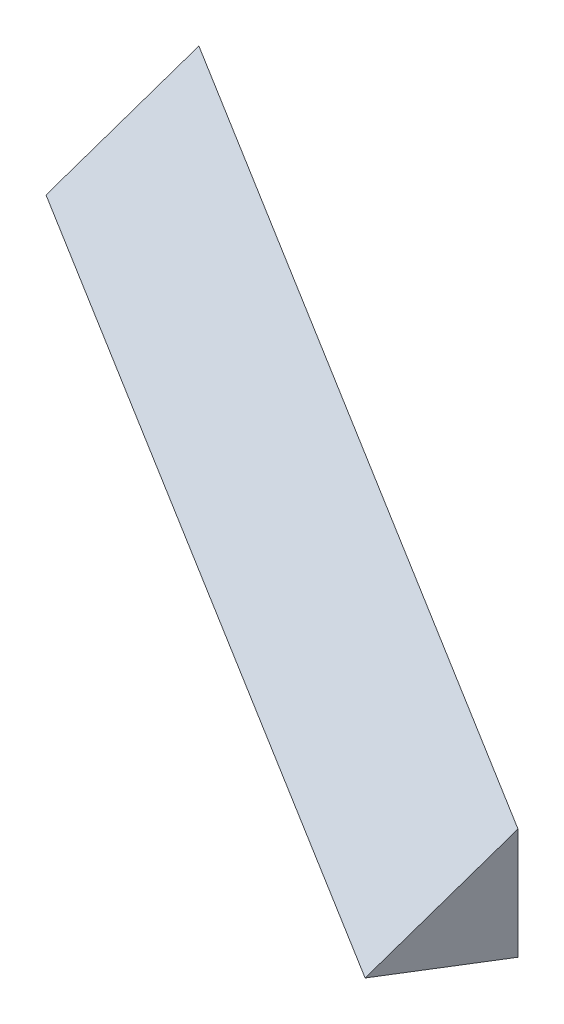
ISO-10303-21;
HEADER;
FILE_DESCRIPTION(('STEP AP214'),'2;1');
FILE_NAME('part.step','',(''),(''),'','','');
FILE_SCHEMA(('AUTOMOTIVE_DESIGN { 1 0 10303 214 1 1 1 1 }'));
ENDSEC;
DATA;
#1=APPLICATION_CONTEXT('core data for automotive mechanical design processes');
#2=APPLICATION_PROTOCOL_DEFINITION('international standard','automotive_design',2000,#1);
#3=PRODUCT_CONTEXT('',#1,'mechanical');
#4=PRODUCT('Part','Part','',(#3));
#5=PRODUCT_RELATED_PRODUCT_CATEGORY('part','',(#4));
#6=PRODUCT_DEFINITION_FORMATION('','',#4);
#7=PRODUCT_DEFINITION_CONTEXT('part definition',#1,'design');
#8=PRODUCT_DEFINITION('design','',#6,#7);
#9=PRODUCT_DEFINITION_SHAPE('','',#8);
#10=(LENGTH_UNIT() NAMED_UNIT(*) SI_UNIT(.MILLI.,.METRE.));
#11=(NAMED_UNIT(*) PLANE_ANGLE_UNIT() SI_UNIT($,.RADIAN.));
#12=(NAMED_UNIT(*) SI_UNIT($,.STERADIAN.) SOLID_ANGLE_UNIT());
#13=UNCERTAINTY_MEASURE_WITH_UNIT(LENGTH_MEASURE(1.E-05),#10,'distance_accuracy_value','');
#14=(GEOMETRIC_REPRESENTATION_CONTEXT(3) GLOBAL_UNCERTAINTY_ASSIGNED_CONTEXT((#13)) GLOBAL_UNIT_ASSIGNED_CONTEXT((#10,
#11,#12)) REPRESENTATION_CONTEXT('',''));
#15=CARTESIAN_POINT('',(0.,0.,0.));
#16=DIRECTION('',(0.,0.,1.));
#17=DIRECTION('',(1.,0.,0.));
#18=AXIS2_PLACEMENT_3D('',#15,#16,#17);
#19=CARTESIAN_POINT('',(79.6720030881752,-36.7033581620617,263.892845775525));
#20=DIRECTION('',(0.850265146687862,0.,0.526354614616295));
#21=DIRECTION('',(-0.526354614616295,0.,0.850265146687862));
#22=AXIS2_PLACEMENT_3D('',#19,#20,#21);
#23=PLANE('',#22);
#24=DIRECTION('',(0.,-1.,0.));
#25=VECTOR('',#24,1.);
#26=CARTESIAN_POINT('',(79.6714767335604,-37.9271790810309,263.893696040671));
#27=LINE('',#26,#25);
#28=CARTESIAN_POINT('',(79.6714767335608,-36.7043581620616,263.893696040671));
#29=VERTEX_POINT('',#28);
#30=CARTESIAN_POINT('',(79.6714767335608,-39.15,263.893696040671));
#31=VERTEX_POINT('',#30);
#32=EDGE_CURVE('E20',#29,#31,#27,.T.);
#33=ORIENTED_EDGE('',*,*,#32,.F.);
#34=DIRECTION('',(0.37218891730405,0.70710678118665,-0.601228251029419));
#35=VECTOR('',#34,1.);
#36=CARTESIAN_POINT('',(79.0278393000121,-37.9271790810308,264.933418048712));
#37=LINE('',#36,#35);
#38=CARTESIAN_POINT('',(78.3842018664631,-39.1500000000001,265.973140056752));
#39=VERTEX_POINT('',#38);
#40=EDGE_CURVE('E56',#39,#29,#37,.T.);
#41=ORIENTED_EDGE('',*,*,#40,.F.);
#42=DIRECTION('',(-0.526354614616307,0.,0.850265146687854));
#43=VECTOR('',#42,1.);
#44=CARTESIAN_POINT('',(79.0278393000117,-39.1500000000001,264.933418048711));
#45=LINE('',#44,#43);
#46=EDGE_CURVE('E52',#31,#39,#45,.T.);
#47=ORIENTED_EDGE('',*,*,#46,.F.);
#48=EDGE_LOOP('',(#33,#41,#47));
#49=FACE_BOUND('',#48,.T.);
#50=ADVANCED_FACE('F16',(#49),#23,.T.);
#51=CARTESIAN_POINT('',(79.6723269987073,-36.7033581620616,263.894222395286));
#52=DIRECTION('',(0.526354614616318,0.,-0.850265146687848));
#53=DIRECTION('',(0.,-1.,0.));
#54=AXIS2_PLACEMENT_3D('',#51,#52,#53);
#55=PLANE('',#54);
#56=DIRECTION('',(0.,-1.,0.));
#57=VECTOR('',#56,1.);
#58=CARTESIAN_POINT('',(61.2222721736241,-37.9271790810309,252.47275988452));
#59=LINE('',#58,#57);
#60=CARTESIAN_POINT('',(61.2222721736243,-36.7043581620617,252.47275988452));
#61=VERTEX_POINT('',#60);
#62=CARTESIAN_POINT('',(61.2222721736242,-39.1500000000001,252.47275988452));
#63=VERTEX_POINT('',#62);
#64=EDGE_CURVE('E47',#61,#63,#59,.T.);
#65=ORIENTED_EDGE('',*,*,#64,.F.);
#66=DIRECTION('',(-0.850265146687851,0.,-0.526354614616313));
#67=VECTOR('',#66,1.);
#68=CARTESIAN_POINT('',(70.4468744535925,-36.7043581620615,258.183227962595));
#69=LINE('',#68,#67);
#70=EDGE_CURVE('E65',#29,#61,#69,.T.);
#71=ORIENTED_EDGE('',*,*,#70,.F.);
#72=ORIENTED_EDGE('',*,*,#32,.T.);
#73=DIRECTION('',(0.850265146687868,0.,0.526354614616286));
#74=VECTOR('',#73,1.);
#75=CARTESIAN_POINT('',(70.4468744535925,-39.1500000000001,258.183227962595));
#76=LINE('',#75,#74);
#77=EDGE_CURVE('E63',#63,#31,#76,.T.);
#78=ORIENTED_EDGE('',*,*,#77,.F.);
#79=EDGE_LOOP('',(#65,#71,#72,#78));
#80=FACE_BOUND('',#79,.T.);
#81=ADVANCED_FACE('F62',(#80),#55,.T.);
#82=CARTESIAN_POINT('',(59.934470951912,-36.7033581620617,254.553054165747));
#83=DIRECTION('',(-0.850265146687848,0.,-0.526354614616318));
#84=DIRECTION('',(0.526354614616318,0.,-0.850265146687848));
#85=AXIS2_PLACEMENT_3D('',#82,#83,#84);
#86=PLANE('',#85);
#87=DIRECTION('',(-0.372188917304007,-0.707106781186515,0.601228251029603));
#88=VECTOR('',#87,1.);
#89=CARTESIAN_POINT('',(60.5786347400755,-37.9271790810309,253.51248189256));
#90=LINE('',#89,#88);
#91=CARTESIAN_POINT('',(59.9349973065264,-39.1500000000001,254.552203900601));
#92=VERTEX_POINT('',#91);
#93=EDGE_CURVE('E27',#61,#92,#90,.T.);
#94=ORIENTED_EDGE('',*,*,#93,.F.);
#95=ORIENTED_EDGE('',*,*,#64,.T.);
#96=DIRECTION('',(0.526354614616289,0.,-0.850265146687866));
#97=VECTOR('',#96,1.);
#98=CARTESIAN_POINT('',(60.5786347400754,-39.1500000000001,253.512481892561));
#99=LINE('',#98,#97);
#100=EDGE_CURVE('E36',#92,#63,#99,.T.);
#101=ORIENTED_EDGE('',*,*,#100,.F.);
#102=EDGE_LOOP('',(#94,#95,#101));
#103=FACE_BOUND('',#102,.T.);
#104=ADVANCED_FACE('F89',(#103),#86,.T.);
#105=CARTESIAN_POINT('',(79.6728533533219,-39.1500000000001,263.893372130139));
#106=DIRECTION('',(0.,-1.,0.));
#107=DIRECTION('',(-0.526354614616301,0.,0.850265146687858));
#108=AXIS2_PLACEMENT_3D('',#105,#106,#107);
#109=PLANE('',#108);
#110=ORIENTED_EDGE('',*,*,#100,.T.);
#111=ORIENTED_EDGE('',*,*,#77,.T.);
#112=ORIENTED_EDGE('',*,*,#46,.T.);
#113=DIRECTION('',(0.85026514668787,0.,0.526354614616283));
#114=VECTOR('',#113,1.);
#115=CARTESIAN_POINT('',(69.1595995864948,-39.1500000000003,260.262671978676));
#116=LINE('',#115,#114);
#117=EDGE_CURVE('E11',#92,#39,#116,.T.);
#118=ORIENTED_EDGE('',*,*,#117,.F.);
#119=EDGE_LOOP('',(#110,#111,#112,#118));
#120=FACE_BOUND('',#119,.T.);
#121=ADVANCED_FACE('F67',(#120),#109,.T.);
#122=CARTESIAN_POINT('',(78.3846799426925,-39.1507071067813,265.974267639617));
#123=DIRECTION('',(-0.372188917304059,0.707106781186445,0.601228251029654));
#124=DIRECTION('',(0.37218891730405,0.70710678118665,-0.601228251029419));
#125=AXIS2_PLACEMENT_3D('',#122,#123,#124);
#126=PLANE('',#125);
#127=ORIENTED_EDGE('',*,*,#93,.T.);
#128=ORIENTED_EDGE('',*,*,#117,.T.);
#129=ORIENTED_EDGE('',*,*,#40,.T.);
#130=ORIENTED_EDGE('',*,*,#70,.T.);
#131=EDGE_LOOP('',(#127,#128,#129,#130));
#132=FACE_BOUND('',#131,.T.);
#133=ADVANCED_FACE('F18',(#132),#126,.T.);
#134=CLOSED_SHELL('',(#50,#81,#104,#121,#133));
#135=MANIFOLD_SOLID_BREP('B1',#134);
#136=ADVANCED_BREP_SHAPE_REPRESENTATION('',(#18,#135),#14);
#137=SHAPE_DEFINITION_REPRESENTATION(#9,#136);
ENDSEC;
END-ISO-10303-21;
